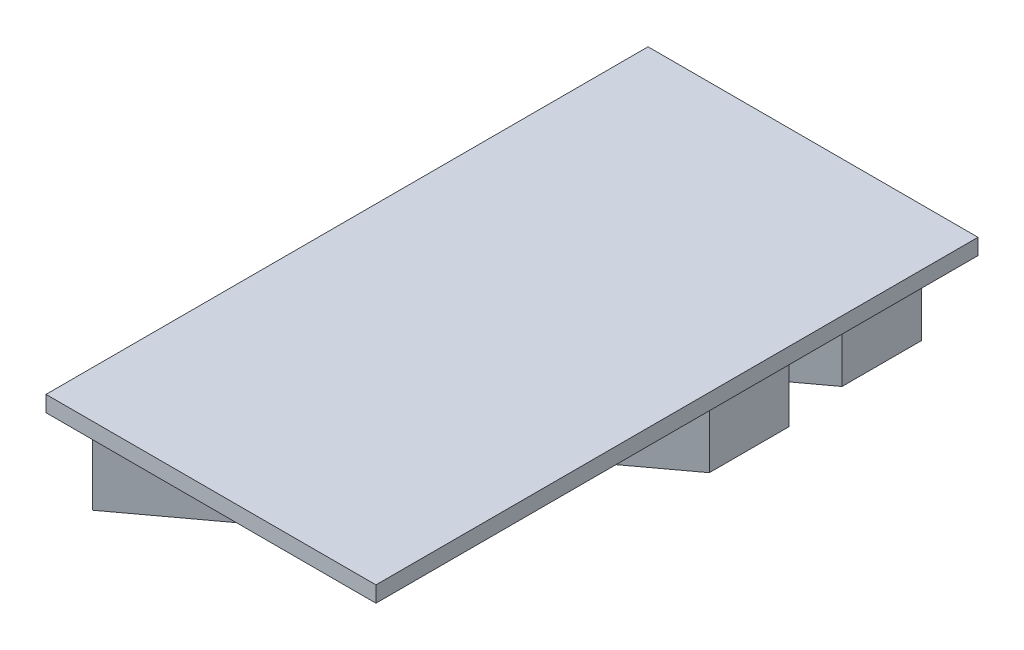
ISO-10303-21;
HEADER;
FILE_DESCRIPTION(('STEP AP214'),'2;1');
FILE_NAME('part.step','',(''),(''),'','','');
FILE_SCHEMA(('AUTOMOTIVE_DESIGN { 1 0 10303 214 1 1 1 1 }'));
ENDSEC;
DATA;
#1=APPLICATION_CONTEXT('core data for automotive mechanical design processes');
#2=APPLICATION_PROTOCOL_DEFINITION('international standard','automotive_design',2000,#1);
#3=PRODUCT_CONTEXT('',#1,'mechanical');
#4=PRODUCT('Part','Part','',(#3));
#5=PRODUCT_RELATED_PRODUCT_CATEGORY('part','',(#4));
#6=PRODUCT_DEFINITION_FORMATION('','',#4);
#7=PRODUCT_DEFINITION_CONTEXT('part definition',#1,'design');
#8=PRODUCT_DEFINITION('design','',#6,#7);
#9=PRODUCT_DEFINITION_SHAPE('','',#8);
#10=(LENGTH_UNIT() NAMED_UNIT(*) SI_UNIT(.MILLI.,.METRE.));
#11=(NAMED_UNIT(*) PLANE_ANGLE_UNIT() SI_UNIT($,.RADIAN.));
#12=(NAMED_UNIT(*) SI_UNIT($,.STERADIAN.) SOLID_ANGLE_UNIT());
#13=UNCERTAINTY_MEASURE_WITH_UNIT(LENGTH_MEASURE(1.E-05),#10,'distance_accuracy_value','');
#14=(GEOMETRIC_REPRESENTATION_CONTEXT(3) GLOBAL_UNCERTAINTY_ASSIGNED_CONTEXT((#13)) GLOBAL_UNIT_ASSIGNED_CONTEXT((#10,
#11,#12)) REPRESENTATION_CONTEXT('',''));
#15=CARTESIAN_POINT('',(0.,0.,0.));
#16=DIRECTION('',(0.,0.,1.));
#17=DIRECTION('',(1.,0.,0.));
#18=AXIS2_PLACEMENT_3D('',#15,#16,#17);
#19=CARTESIAN_POINT('',(0.,1.5,0.));
#20=DIRECTION('',(0.,1.,0.));
#21=DIRECTION('',(0.,0.,1.));
#22=AXIS2_PLACEMENT_3D('',#19,#20,#21);
#23=PLANE('',#22);
#24=DIRECTION('',(-0.804048076479919,0.,0.59456428643919));
#25=VECTOR('',#24,1.);
#26=CARTESIAN_POINT('',(2.25024903153857,1.5,-2.45548713272482));
#27=LINE('',#26,#25);
#28=CARTESIAN_POINT('',(2.25024903153857,1.5,-2.45548713272482));
#29=VERTEX_POINT('',#28);
#30=CARTESIAN_POINT('',(-3.02390068047156,1.5,1.44455460834024));
#31=VERTEX_POINT('',#30);
#32=EDGE_CURVE('E181',#29,#31,#27,.T.);
#33=ORIENTED_EDGE('',*,*,#32,.T.);
#34=DIRECTION('',(0.,0.,1.));
#35=VECTOR('',#34,1.);
#36=CARTESIAN_POINT('',(-3.02390068047156,1.5,1.44455460834024));
#37=LINE('',#36,#35);
#38=CARTESIAN_POINT('',(-3.02390068047156,1.5,2.94588618290913));
#39=VERTEX_POINT('',#38);
#40=EDGE_CURVE('E183',#31,#39,#37,.T.);
#41=ORIENTED_EDGE('',*,*,#40,.T.);
#42=DIRECTION('',(0.804048076479919,0.,-0.59456428643919));
#43=VECTOR('',#42,1.);
#44=CARTESIAN_POINT('',(2.25024903153857,1.5,-0.954155558155932));
#45=LINE('',#44,#43);
#46=CARTESIAN_POINT('',(2.25024903153857,1.5,-0.954155558155932));
#47=VERTEX_POINT('',#46);
#48=EDGE_CURVE('E186',#39,#47,#45,.T.);
#49=ORIENTED_EDGE('',*,*,#48,.T.);
#50=DIRECTION('',(0.,0.,-1.));
#51=VECTOR('',#50,1.);
#52=CARTESIAN_POINT('',(2.25024903153857,1.5,-2.45548713272482));
#53=LINE('',#52,#51);
#54=EDGE_CURVE('E188',#47,#29,#53,.T.);
#55=ORIENTED_EDGE('',*,*,#54,.T.);
#56=EDGE_LOOP('',(#33,#41,#49,#55));
#57=FACE_BOUND('',#56,.T.);
#58=DIRECTION('',(0.,0.,1.));
#59=VECTOR('',#58,1.);
#60=CARTESIAN_POINT('',(-3.48671320168795,1.5,-5.53531411438628));
#61=LINE('',#60,#59);
#62=CARTESIAN_POINT('',(-3.48671320168795,1.5,-5.53531411438628));
#63=VERTEX_POINT('',#62);
#64=CARTESIAN_POINT('',(-3.48671320168795,1.5,5.82267323575311));
#65=VERTEX_POINT('',#64);
#66=EDGE_CURVE('E209',#63,#65,#61,.T.);
#67=ORIENTED_EDGE('',*,*,#66,.F.);
#68=DIRECTION('',(-1.,0.,0.));
#69=VECTOR('',#68,1.);
#70=CARTESIAN_POINT('',(-3.48671320168795,1.5,-5.53531411438628));
#71=LINE('',#70,#69);
#72=CARTESIAN_POINT('',(2.73786065177273,1.5,-5.53531411438628));
#73=VERTEX_POINT('',#72);
#74=EDGE_CURVE('E214',#73,#63,#71,.T.);
#75=ORIENTED_EDGE('',*,*,#74,.F.);
#76=DIRECTION('',(0.,0.,-1.));
#77=VECTOR('',#76,1.);
#78=CARTESIAN_POINT('',(2.73786065177273,1.5,-5.53531411438628));
#79=LINE('',#78,#77);
#80=CARTESIAN_POINT('',(2.73786065177273,1.5,5.82267323575311));
#81=VERTEX_POINT('',#80);
#82=EDGE_CURVE('E225',#81,#73,#79,.T.);
#83=ORIENTED_EDGE('',*,*,#82,.F.);
#84=DIRECTION('',(1.,0.,0.));
#85=VECTOR('',#84,1.);
#86=CARTESIAN_POINT('',(-3.48671320168795,1.5,5.82267323575311));
#87=LINE('',#86,#85);
#88=EDGE_CURVE('E223',#65,#81,#87,.T.);
#89=ORIENTED_EDGE('',*,*,#88,.F.);
#90=EDGE_LOOP('',(#67,#75,#83,#89));
#91=FACE_BOUND('',#90,.T.);
#92=DIRECTION('',(0.,0.,-1.));
#93=VECTOR('',#92,1.);
#94=CARTESIAN_POINT('',(-0.539241248613064,1.5,2.18897007289775));
#95=LINE('',#94,#93);
#96=CARTESIAN_POINT('',(-0.539241248613064,1.5,3.69030164746641));
#97=VERTEX_POINT('',#96);
#98=CARTESIAN_POINT('',(-0.539241248613064,1.5,2.18897007289775));
#99=VERTEX_POINT('',#98);
#100=EDGE_CURVE('E250',#97,#99,#95,.T.);
#101=ORIENTED_EDGE('',*,*,#100,.T.);
#102=DIRECTION('',(-0.804048076479919,0.,0.59456428643919));
#103=VECTOR('',#102,1.);
#104=CARTESIAN_POINT('',(-0.539241248613064,1.5,2.18897007289775));
#105=LINE('',#104,#103);
#106=CARTESIAN_POINT('',(-2.95667956111279,1.5,3.97657771394166));
#107=VERTEX_POINT('',#106);
#108=EDGE_CURVE('E240',#99,#107,#105,.T.);
#109=ORIENTED_EDGE('',*,*,#108,.T.);
#110=DIRECTION('',(0.,0.,1.));
#111=VECTOR('',#110,1.);
#112=CARTESIAN_POINT('',(-2.95667956111279,1.5,3.97657771394166));
#113=LINE('',#112,#111);
#114=CARTESIAN_POINT('',(-2.95667956111279,1.5,5.47790928851032));
#115=VERTEX_POINT('',#114);
#116=EDGE_CURVE('E243',#107,#115,#113,.T.);
#117=ORIENTED_EDGE('',*,*,#116,.T.);
#118=DIRECTION('',(0.804048076479919,0.,-0.59456428643919));
#119=VECTOR('',#118,1.);
#120=CARTESIAN_POINT('',(-0.539241248613064,1.5,3.69030164746641));
#121=LINE('',#120,#119);
#122=EDGE_CURVE('E247',#115,#97,#121,.T.);
#123=ORIENTED_EDGE('',*,*,#122,.T.);
#124=EDGE_LOOP('',(#101,#109,#117,#123));
#125=FACE_BOUND('',#124,.T.);
#126=DIRECTION('',(-0.804048076479919,0.,0.59456428643919));
#127=VECTOR('',#126,1.);
#128=CARTESIAN_POINT('',(2.09356417522834,1.5,-5.11615287009016));
#129=LINE('',#128,#127);
#130=CARTESIAN_POINT('',(2.09356417522834,1.5,-5.11615287009016));
#131=VERTEX_POINT('',#130);
#132=CARTESIAN_POINT('',(-0.323874137271384,1.5,-3.32854522904625));
#133=VERTEX_POINT('',#132);
#134=EDGE_CURVE('E50',#131,#133,#129,.T.);
#135=ORIENTED_EDGE('',*,*,#134,.T.);
#136=DIRECTION('',(0.,0.,1.));
#137=VECTOR('',#136,1.);
#138=CARTESIAN_POINT('',(-0.323874137271384,1.5,-3.32854522904625));
#139=LINE('',#138,#137);
#140=CARTESIAN_POINT('',(-0.323874137271383,1.5,-1.82721365447736));
#141=VERTEX_POINT('',#140);
#142=EDGE_CURVE('E54',#133,#141,#139,.T.);
#143=ORIENTED_EDGE('',*,*,#142,.T.);
#144=DIRECTION('',(0.804048076479919,0.,-0.59456428643919));
#145=VECTOR('',#144,1.);
#146=CARTESIAN_POINT('',(2.09356417522834,1.5,-3.61482129552127));
#147=LINE('',#146,#145);
#148=CARTESIAN_POINT('',(2.09356417522834,1.5,-3.61482129552127));
#149=VERTEX_POINT('',#148);
#150=EDGE_CURVE('E144',#141,#149,#147,.T.);
#151=ORIENTED_EDGE('',*,*,#150,.T.);
#152=DIRECTION('',(0.,0.,-1.));
#153=VECTOR('',#152,1.);
#154=CARTESIAN_POINT('',(2.09356417522834,1.5,-5.11615287009016));
#155=LINE('',#154,#153);
#156=EDGE_CURVE('E147',#149,#131,#155,.T.);
#157=ORIENTED_EDGE('',*,*,#156,.T.);
#158=EDGE_LOOP('',(#135,#143,#151,#157));
#159=FACE_BOUND('',#158,.T.);
#160=ADVANCED_FACE('F35',(#57,#91,#125,#159),#23,.F.);
#161=CARTESIAN_POINT('',(-0.539241248613064,1.5,2.18897007289775));
#162=DIRECTION('',(0.59456428643919,0.,0.804048076479919));
#163=DIRECTION('',(0.804048076479919,0.,-0.59456428643919));
#164=AXIS2_PLACEMENT_3D('',#161,#162,#163);
#165=PLANE('',#164);
#166=DIRECTION('',(-0.804048076479919,0.,0.59456428643919));
#167=VECTOR('',#166,1.);
#168=CARTESIAN_POINT('',(-0.539241248613064,0.,2.18897007289775));
#169=LINE('',#168,#167);
#170=CARTESIAN_POINT('',(-0.539241248613064,0.,2.18897007289775));
#171=VERTEX_POINT('',#170);
#172=CARTESIAN_POINT('',(-2.95667956111279,0.,3.97657771394166));
#173=VERTEX_POINT('',#172);
#174=EDGE_CURVE('E239',#171,#173,#169,.T.);
#175=ORIENTED_EDGE('',*,*,#174,.T.);
#176=DIRECTION('',(0.,-1.,0.));
#177=VECTOR('',#176,1.);
#178=CARTESIAN_POINT('',(-2.95667956111279,1.5,3.97657771394166));
#179=LINE('',#178,#177);
#180=EDGE_CURVE('E11',#107,#173,#179,.T.);
#181=ORIENTED_EDGE('',*,*,#180,.F.);
#182=ORIENTED_EDGE('',*,*,#108,.F.);
#183=DIRECTION('',(0.,-1.,0.));
#184=VECTOR('',#183,1.);
#185=CARTESIAN_POINT('',(-0.539241248613064,1.5,2.18897007289775));
#186=LINE('',#185,#184);
#187=EDGE_CURVE('E253',#99,#171,#186,.T.);
#188=ORIENTED_EDGE('',*,*,#187,.T.);
#189=EDGE_LOOP('',(#175,#181,#182,#188));
#190=FACE_BOUND('',#189,.T.);
#191=ADVANCED_FACE('F37',(#190),#165,.F.);
#192=CARTESIAN_POINT('',(-2.95667956111279,1.5,3.97657771394166));
#193=DIRECTION('',(1.,0.,0.));
#194=DIRECTION('',(0.,0.,-1.));
#195=AXIS2_PLACEMENT_3D('',#192,#193,#194);
#196=PLANE('',#195);
#197=DIRECTION('',(0.,0.,1.));
#198=VECTOR('',#197,1.);
#199=CARTESIAN_POINT('',(-2.95667956111279,0.,3.97657771394166));
#200=LINE('',#199,#198);
#201=CARTESIAN_POINT('',(-2.95667956111279,0.,5.47790928851032));
#202=VERTEX_POINT('',#201);
#203=EDGE_CURVE('E256',#173,#202,#200,.T.);
#204=ORIENTED_EDGE('',*,*,#203,.T.);
#205=DIRECTION('',(0.,-1.,0.));
#206=VECTOR('',#205,1.);
#207=CARTESIAN_POINT('',(-2.95667956111279,1.5,5.47790928851032));
#208=LINE('',#207,#206);
#209=EDGE_CURVE('E43',#115,#202,#208,.T.);
#210=ORIENTED_EDGE('',*,*,#209,.F.);
#211=ORIENTED_EDGE('',*,*,#116,.F.);
#212=ORIENTED_EDGE('',*,*,#180,.T.);
#213=EDGE_LOOP('',(#204,#210,#211,#212));
#214=FACE_BOUND('',#213,.T.);
#215=ADVANCED_FACE('F282',(#214),#196,.F.);
#216=CARTESIAN_POINT('',(-0.539241248613064,1.5,3.69030164746641));
#217=DIRECTION('',(-0.59456428643919,0.,-0.804048076479919));
#218=DIRECTION('',(-0.804048076479919,0.,0.59456428643919));
#219=AXIS2_PLACEMENT_3D('',#216,#217,#218);
#220=PLANE('',#219);
#221=DIRECTION('',(0.804048076479919,0.,-0.59456428643919));
#222=VECTOR('',#221,1.);
#223=CARTESIAN_POINT('',(-0.539241248613064,0.,3.69030164746641));
#224=LINE('',#223,#222);
#225=CARTESIAN_POINT('',(-0.539241248613064,0.,3.69030164746641));
#226=VERTEX_POINT('',#225);
#227=EDGE_CURVE('E258',#202,#226,#224,.T.);
#228=ORIENTED_EDGE('',*,*,#227,.T.);
#229=DIRECTION('',(0.,-1.,0.));
#230=VECTOR('',#229,1.);
#231=CARTESIAN_POINT('',(-0.539241248613064,1.5,3.69030164746641));
#232=LINE('',#231,#230);
#233=EDGE_CURVE('E263',#97,#226,#232,.T.);
#234=ORIENTED_EDGE('',*,*,#233,.F.);
#235=ORIENTED_EDGE('',*,*,#122,.F.);
#236=ORIENTED_EDGE('',*,*,#209,.T.);
#237=EDGE_LOOP('',(#228,#234,#235,#236));
#238=FACE_BOUND('',#237,.T.);
#239=ADVANCED_FACE('F269',(#238),#220,.F.);
#240=CARTESIAN_POINT('',(-0.539241248613064,1.5,2.18897007289775));
#241=DIRECTION('',(-1.,0.,0.));
#242=DIRECTION('',(0.,0.,1.));
#243=AXIS2_PLACEMENT_3D('',#240,#241,#242);
#244=PLANE('',#243);
#245=DIRECTION('',(0.,0.,-1.));
#246=VECTOR('',#245,1.);
#247=CARTESIAN_POINT('',(-0.539241248613064,0.,2.18897007289775));
#248=LINE('',#247,#246);
#249=EDGE_CURVE('E244',#226,#171,#248,.T.);
#250=ORIENTED_EDGE('',*,*,#249,.T.);
#251=ORIENTED_EDGE('',*,*,#187,.F.);
#252=ORIENTED_EDGE('',*,*,#100,.F.);
#253=ORIENTED_EDGE('',*,*,#233,.T.);
#254=EDGE_LOOP('',(#250,#251,#252,#253));
#255=FACE_BOUND('',#254,.T.);
#256=ADVANCED_FACE('F277',(#255),#244,.F.);
#257=CARTESIAN_POINT('',(0.,0.,0.));
#258=DIRECTION('',(0.,1.,0.));
#259=DIRECTION('',(0.,0.,1.));
#260=AXIS2_PLACEMENT_3D('',#257,#258,#259);
#261=PLANE('',#260);
#262=ORIENTED_EDGE('',*,*,#174,.F.);
#263=ORIENTED_EDGE('',*,*,#249,.F.);
#264=ORIENTED_EDGE('',*,*,#227,.F.);
#265=ORIENTED_EDGE('',*,*,#203,.F.);
#266=EDGE_LOOP('',(#262,#263,#264,#265));
#267=FACE_BOUND('',#266,.T.);
#268=ADVANCED_FACE('F274',(#267),#261,.F.);
#269=CARTESIAN_POINT('',(-3.48671320168795,1.8,-5.53531411438628));
#270=DIRECTION('',(1.,0.,0.));
#271=DIRECTION('',(0.,0.,-1.));
#272=AXIS2_PLACEMENT_3D('',#269,#270,#271);
#273=PLANE('',#272);
#274=ORIENTED_EDGE('',*,*,#66,.T.);
#275=DIRECTION('',(0.,-1.,0.));
#276=VECTOR('',#275,1.);
#277=CARTESIAN_POINT('',(-3.48671320168795,1.8,5.82267323575311));
#278=LINE('',#277,#276);
#279=CARTESIAN_POINT('',(-3.48671320168795,1.8,5.82267323575311));
#280=VERTEX_POINT('',#279);
#281=EDGE_CURVE('E236',#280,#65,#278,.T.);
#282=ORIENTED_EDGE('',*,*,#281,.F.);
#283=DIRECTION('',(0.,0.,1.));
#284=VECTOR('',#283,1.);
#285=CARTESIAN_POINT('',(-3.48671320168795,1.8,-5.53531411438628));
#286=LINE('',#285,#284);
#287=CARTESIAN_POINT('',(-3.48671320168795,1.8,-5.53531411438628));
#288=VERTEX_POINT('',#287);
#289=EDGE_CURVE('E210',#288,#280,#286,.T.);
#290=ORIENTED_EDGE('',*,*,#289,.F.);
#291=DIRECTION('',(0.,-1.,0.));
#292=VECTOR('',#291,1.);
#293=CARTESIAN_POINT('',(-3.48671320168795,1.8,-5.53531411438628));
#294=LINE('',#293,#292);
#295=EDGE_CURVE('E220',#288,#63,#294,.T.);
#296=ORIENTED_EDGE('',*,*,#295,.T.);
#297=EDGE_LOOP('',(#274,#282,#290,#296));
#298=FACE_BOUND('',#297,.T.);
#299=ADVANCED_FACE('F310',(#298),#273,.F.);
#300=CARTESIAN_POINT('',(-3.48671320168795,1.8,5.82267323575311));
#301=DIRECTION('',(0.,0.,-1.));
#302=DIRECTION('',(-1.,0.,0.));
#303=AXIS2_PLACEMENT_3D('',#300,#301,#302);
#304=PLANE('',#303);
#305=ORIENTED_EDGE('',*,*,#88,.T.);
#306=DIRECTION('',(0.,-1.,0.));
#307=VECTOR('',#306,1.);
#308=CARTESIAN_POINT('',(2.73786065177273,1.8,5.82267323575311));
#309=LINE('',#308,#307);
#310=CARTESIAN_POINT('',(2.73786065177273,1.8,5.82267323575311));
#311=VERTEX_POINT('',#310);
#312=EDGE_CURVE('E233',#311,#81,#309,.T.);
#313=ORIENTED_EDGE('',*,*,#312,.F.);
#314=DIRECTION('',(1.,0.,0.));
#315=VECTOR('',#314,1.);
#316=CARTESIAN_POINT('',(-3.48671320168795,1.8,5.82267323575311));
#317=LINE('',#316,#315);
#318=EDGE_CURVE('E213',#280,#311,#317,.T.);
#319=ORIENTED_EDGE('',*,*,#318,.F.);
#320=ORIENTED_EDGE('',*,*,#281,.T.);
#321=EDGE_LOOP('',(#305,#313,#319,#320));
#322=FACE_BOUND('',#321,.T.);
#323=ADVANCED_FACE('F306',(#322),#304,.F.);
#324=CARTESIAN_POINT('',(2.73786065177273,1.8,-5.53531411438628));
#325=DIRECTION('',(-1.,0.,0.));
#326=DIRECTION('',(0.,0.,1.));
#327=AXIS2_PLACEMENT_3D('',#324,#325,#326);
#328=PLANE('',#327);
#329=ORIENTED_EDGE('',*,*,#82,.T.);
#330=DIRECTION('',(0.,-1.,0.));
#331=VECTOR('',#330,1.);
#332=CARTESIAN_POINT('',(2.73786065177273,1.8,-5.53531411438628));
#333=LINE('',#332,#331);
#334=CARTESIAN_POINT('',(2.73786065177273,1.8,-5.53531411438628));
#335=VERTEX_POINT('',#334);
#336=EDGE_CURVE('E230',#335,#73,#333,.T.);
#337=ORIENTED_EDGE('',*,*,#336,.F.);
#338=DIRECTION('',(0.,0.,-1.));
#339=VECTOR('',#338,1.);
#340=CARTESIAN_POINT('',(2.73786065177273,1.8,-5.53531411438628));
#341=LINE('',#340,#339);
#342=EDGE_CURVE('E216',#311,#335,#341,.T.);
#343=ORIENTED_EDGE('',*,*,#342,.F.);
#344=ORIENTED_EDGE('',*,*,#312,.T.);
#345=EDGE_LOOP('',(#329,#337,#343,#344));
#346=FACE_BOUND('',#345,.T.);
#347=ADVANCED_FACE('F302',(#346),#328,.F.);
#348=CARTESIAN_POINT('',(-3.48671320168795,1.8,-5.53531411438628));
#349=DIRECTION('',(0.,0.,1.));
#350=DIRECTION('',(1.,0.,0.));
#351=AXIS2_PLACEMENT_3D('',#348,#349,#350);
#352=PLANE('',#351);
#353=ORIENTED_EDGE('',*,*,#74,.T.);
#354=ORIENTED_EDGE('',*,*,#295,.F.);
#355=DIRECTION('',(-1.,0.,0.));
#356=VECTOR('',#355,1.);
#357=CARTESIAN_POINT('',(-3.48671320168795,1.8,-5.53531411438628));
#358=LINE('',#357,#356);
#359=EDGE_CURVE('E218',#335,#288,#358,.T.);
#360=ORIENTED_EDGE('',*,*,#359,.F.);
#361=ORIENTED_EDGE('',*,*,#336,.T.);
#362=EDGE_LOOP('',(#353,#354,#360,#361));
#363=FACE_BOUND('',#362,.T.);
#364=ADVANCED_FACE('F299',(#363),#352,.F.);
#365=CARTESIAN_POINT('',(0.,1.8,0.));
#366=DIRECTION('',(0.,1.,0.));
#367=DIRECTION('',(0.,0.,1.));
#368=AXIS2_PLACEMENT_3D('',#365,#366,#367);
#369=PLANE('',#368);
#370=ORIENTED_EDGE('',*,*,#289,.T.);
#371=ORIENTED_EDGE('',*,*,#318,.T.);
#372=ORIENTED_EDGE('',*,*,#342,.T.);
#373=ORIENTED_EDGE('',*,*,#359,.T.);
#374=EDGE_LOOP('',(#370,#371,#372,#373));
#375=FACE_BOUND('',#374,.T.);
#376=ADVANCED_FACE('F297',(#375),#369,.T.);
#377=CARTESIAN_POINT('',(2.25024903153857,1.5,-2.45548713272482));
#378=DIRECTION('',(0.59456428643919,0.,0.804048076479919));
#379=DIRECTION('',(0.804048076479919,0.,-0.59456428643919));
#380=AXIS2_PLACEMENT_3D('',#377,#378,#379);
#381=PLANE('',#380);
#382=DIRECTION('',(-0.804048076479919,0.,0.59456428643919));
#383=VECTOR('',#382,1.);
#384=CARTESIAN_POINT('',(2.25024903153857,0.,-2.45548713272482));
#385=LINE('',#384,#383);
#386=CARTESIAN_POINT('',(2.25024903153857,0.,-2.45548713272482));
#387=VERTEX_POINT('',#386);
#388=CARTESIAN_POINT('',(-3.02390068047156,0.,1.44455460834024));
#389=VERTEX_POINT('',#388);
#390=EDGE_CURVE('E180',#387,#389,#385,.T.);
#391=ORIENTED_EDGE('',*,*,#390,.T.);
#392=DIRECTION('',(0.,-1.,0.));
#393=VECTOR('',#392,1.);
#394=CARTESIAN_POINT('',(-3.02390068047156,1.5,1.44455460834024));
#395=LINE('',#394,#393);
#396=EDGE_CURVE('E206',#31,#389,#395,.T.);
#397=ORIENTED_EDGE('',*,*,#396,.F.);
#398=ORIENTED_EDGE('',*,*,#32,.F.);
#399=DIRECTION('',(0.,-1.,0.));
#400=VECTOR('',#399,1.);
#401=CARTESIAN_POINT('',(2.25024903153857,1.5,-2.45548713272482));
#402=LINE('',#401,#400);
#403=EDGE_CURVE('E190',#29,#387,#402,.T.);
#404=ORIENTED_EDGE('',*,*,#403,.T.);
#405=EDGE_LOOP('',(#391,#397,#398,#404));
#406=FACE_BOUND('',#405,.T.);
#407=ADVANCED_FACE('F348',(#406),#381,.F.);
#408=CARTESIAN_POINT('',(-3.02390068047156,1.5,1.44455460834024));
#409=DIRECTION('',(1.,0.,0.));
#410=DIRECTION('',(0.,0.,-1.));
#411=AXIS2_PLACEMENT_3D('',#408,#409,#410);
#412=PLANE('',#411);
#413=DIRECTION('',(0.,0.,1.));
#414=VECTOR('',#413,1.);
#415=CARTESIAN_POINT('',(-3.02390068047156,0.,1.44455460834024));
#416=LINE('',#415,#414);
#417=CARTESIAN_POINT('',(-3.02390068047156,0.,2.94588618290913));
#418=VERTEX_POINT('',#417);
#419=EDGE_CURVE('E193',#389,#418,#416,.T.);
#420=ORIENTED_EDGE('',*,*,#419,.T.);
#421=DIRECTION('',(0.,-1.,0.));
#422=VECTOR('',#421,1.);
#423=CARTESIAN_POINT('',(-3.02390068047156,1.5,2.94588618290913));
#424=LINE('',#423,#422);
#425=EDGE_CURVE('E203',#39,#418,#424,.T.);
#426=ORIENTED_EDGE('',*,*,#425,.F.);
#427=ORIENTED_EDGE('',*,*,#40,.F.);
#428=ORIENTED_EDGE('',*,*,#396,.T.);
#429=EDGE_LOOP('',(#420,#426,#427,#428));
#430=FACE_BOUND('',#429,.T.);
#431=ADVANCED_FACE('F355',(#430),#412,.F.);
#432=CARTESIAN_POINT('',(2.25024903153857,1.5,-0.954155558155932));
#433=DIRECTION('',(-0.59456428643919,0.,-0.804048076479919));
#434=DIRECTION('',(-0.804048076479919,0.,0.59456428643919));
#435=AXIS2_PLACEMENT_3D('',#432,#433,#434);
#436=PLANE('',#435);
#437=DIRECTION('',(0.804048076479919,0.,-0.59456428643919));
#438=VECTOR('',#437,1.);
#439=CARTESIAN_POINT('',(2.25024903153857,0.,-0.954155558155932));
#440=LINE('',#439,#438);
#441=CARTESIAN_POINT('',(2.25024903153857,0.,-0.954155558155932));
#442=VERTEX_POINT('',#441);
#443=EDGE_CURVE('E195',#418,#442,#440,.T.);
#444=ORIENTED_EDGE('',*,*,#443,.T.);
#445=DIRECTION('',(0.,-1.,0.));
#446=VECTOR('',#445,1.);
#447=CARTESIAN_POINT('',(2.25024903153857,1.5,-0.954155558155932));
#448=LINE('',#447,#446);
#449=EDGE_CURVE('E200',#47,#442,#448,.T.);
#450=ORIENTED_EDGE('',*,*,#449,.F.);
#451=ORIENTED_EDGE('',*,*,#48,.F.);
#452=ORIENTED_EDGE('',*,*,#425,.T.);
#453=EDGE_LOOP('',(#444,#450,#451,#452));
#454=FACE_BOUND('',#453,.T.);
#455=ADVANCED_FACE('F362',(#454),#436,.F.);
#456=CARTESIAN_POINT('',(2.25024903153857,1.5,-2.45548713272482));
#457=DIRECTION('',(-1.,0.,0.));
#458=DIRECTION('',(0.,0.,1.));
#459=AXIS2_PLACEMENT_3D('',#456,#457,#458);
#460=PLANE('',#459);
#461=DIRECTION('',(0.,0.,-1.));
#462=VECTOR('',#461,1.);
#463=CARTESIAN_POINT('',(2.25024903153857,0.,-2.45548713272482));
#464=LINE('',#463,#462);
#465=EDGE_CURVE('E184',#442,#387,#464,.T.);
#466=ORIENTED_EDGE('',*,*,#465,.T.);
#467=ORIENTED_EDGE('',*,*,#403,.F.);
#468=ORIENTED_EDGE('',*,*,#54,.F.);
#469=ORIENTED_EDGE('',*,*,#449,.T.);
#470=EDGE_LOOP('',(#466,#467,#468,#469));
#471=FACE_BOUND('',#470,.T.);
#472=ADVANCED_FACE('F370',(#471),#460,.F.);
#473=CARTESIAN_POINT('',(0.,0.,0.));
#474=DIRECTION('',(0.,1.,0.));
#475=DIRECTION('',(0.,0.,1.));
#476=AXIS2_PLACEMENT_3D('',#473,#474,#475);
#477=PLANE('',#476);
#478=ORIENTED_EDGE('',*,*,#390,.F.);
#479=ORIENTED_EDGE('',*,*,#465,.F.);
#480=ORIENTED_EDGE('',*,*,#443,.F.);
#481=ORIENTED_EDGE('',*,*,#419,.F.);
#482=EDGE_LOOP('',(#478,#479,#480,#481));
#483=FACE_BOUND('',#482,.T.);
#484=ADVANCED_FACE('F378',(#483),#477,.F.);
#485=CARTESIAN_POINT('',(2.09356417522834,1.5,-5.11615287009016));
#486=DIRECTION('',(0.59456428643919,0.,0.804048076479919));
#487=DIRECTION('',(0.804048076479919,0.,-0.59456428643919));
#488=AXIS2_PLACEMENT_3D('',#485,#486,#487);
#489=PLANE('',#488);
#490=DIRECTION('',(-0.804048076479919,0.,0.59456428643919));
#491=VECTOR('',#490,1.);
#492=CARTESIAN_POINT('',(2.09356417522834,0.,-5.11615287009016));
#493=LINE('',#492,#491);
#494=CARTESIAN_POINT('',(2.09356417522834,0.,-5.11615287009016));
#495=VERTEX_POINT('',#494);
#496=CARTESIAN_POINT('',(-0.323874137271384,0.,-3.32854522904625));
#497=VERTEX_POINT('',#496);
#498=EDGE_CURVE('E168',#495,#497,#493,.T.);
#499=ORIENTED_EDGE('',*,*,#498,.T.);
#500=DIRECTION('',(0.,-1.,0.));
#501=VECTOR('',#500,1.);
#502=CARTESIAN_POINT('',(-0.323874137271384,1.5,-3.32854522904625));
#503=LINE('',#502,#501);
#504=EDGE_CURVE('E177',#133,#497,#503,.T.);
#505=ORIENTED_EDGE('',*,*,#504,.F.);
#506=ORIENTED_EDGE('',*,*,#134,.F.);
#507=DIRECTION('',(0.,-1.,0.));
#508=VECTOR('',#507,1.);
#509=CARTESIAN_POINT('',(2.09356417522834,1.5,-5.11615287009016));
#510=LINE('',#509,#508);
#511=EDGE_CURVE('E160',#131,#495,#510,.T.);
#512=ORIENTED_EDGE('',*,*,#511,.T.);
#513=EDGE_LOOP('',(#499,#505,#506,#512));
#514=FACE_BOUND('',#513,.T.);
#515=ADVANCED_FACE('F386',(#514),#489,.F.);
#516=CARTESIAN_POINT('',(-0.323874137271384,1.5,-3.32854522904625));
#517=DIRECTION('',(1.,0.,0.));
#518=DIRECTION('',(0.,0.,-1.));
#519=AXIS2_PLACEMENT_3D('',#516,#517,#518);
#520=PLANE('',#519);
#521=DIRECTION('',(0.,0.,1.));
#522=VECTOR('',#521,1.);
#523=CARTESIAN_POINT('',(-0.323874137271384,0.,-3.32854522904625));
#524=LINE('',#523,#522);
#525=CARTESIAN_POINT('',(-0.323874137271384,0.,-1.82721365447737));
#526=VERTEX_POINT('',#525);
#527=EDGE_CURVE('E171',#497,#526,#524,.T.);
#528=ORIENTED_EDGE('',*,*,#527,.T.);
#529=DIRECTION('',(0.,-1.,0.));
#530=VECTOR('',#529,1.);
#531=CARTESIAN_POINT('',(-0.323874137271384,1.5,-1.82721365447737));
#532=LINE('',#531,#530);
#533=EDGE_CURVE('E159',#141,#526,#532,.T.);
#534=ORIENTED_EDGE('',*,*,#533,.F.);
#535=ORIENTED_EDGE('',*,*,#142,.F.);
#536=ORIENTED_EDGE('',*,*,#504,.T.);
#537=EDGE_LOOP('',(#528,#534,#535,#536));
#538=FACE_BOUND('',#537,.T.);
#539=ADVANCED_FACE('F394',(#538),#520,.F.);
#540=CARTESIAN_POINT('',(2.09356417522834,1.5,-3.61482129552127));
#541=DIRECTION('',(-0.59456428643919,0.,-0.804048076479919));
#542=DIRECTION('',(-0.804048076479919,0.,0.59456428643919));
#543=AXIS2_PLACEMENT_3D('',#540,#541,#542);
#544=PLANE('',#543);
#545=DIRECTION('',(0.804048076479919,0.,-0.59456428643919));
#546=VECTOR('',#545,1.);
#547=CARTESIAN_POINT('',(2.09356417522834,0.,-3.61482129552127));
#548=LINE('',#547,#546);
#549=CARTESIAN_POINT('',(2.09356417522834,0.,-3.61482129552127));
#550=VERTEX_POINT('',#549);
#551=EDGE_CURVE('E156',#526,#550,#548,.T.);
#552=ORIENTED_EDGE('',*,*,#551,.T.);
#553=DIRECTION('',(0.,-1.,0.));
#554=VECTOR('',#553,1.);
#555=CARTESIAN_POINT('',(2.09356417522834,1.5,-3.61482129552127));
#556=LINE('',#555,#554);
#557=EDGE_CURVE('E153',#149,#550,#556,.T.);
#558=ORIENTED_EDGE('',*,*,#557,.F.);
#559=ORIENTED_EDGE('',*,*,#150,.F.);
#560=ORIENTED_EDGE('',*,*,#533,.T.);
#561=EDGE_LOOP('',(#552,#558,#559,#560));
#562=FACE_BOUND('',#561,.T.);
#563=ADVANCED_FACE('F154',(#562),#544,.F.);
#564=CARTESIAN_POINT('',(2.09356417522834,1.5,-5.11615287009016));
#565=DIRECTION('',(-1.,0.,0.));
#566=DIRECTION('',(0.,0.,1.));
#567=AXIS2_PLACEMENT_3D('',#564,#565,#566);
#568=PLANE('',#567);
#569=DIRECTION('',(0.,0.,-1.));
#570=VECTOR('',#569,1.);
#571=CARTESIAN_POINT('',(2.09356417522834,0.,-5.11615287009016));
#572=LINE('',#571,#570);
#573=EDGE_CURVE('E174',#550,#495,#572,.T.);
#574=ORIENTED_EDGE('',*,*,#573,.T.);
#575=ORIENTED_EDGE('',*,*,#511,.F.);
#576=ORIENTED_EDGE('',*,*,#156,.F.);
#577=ORIENTED_EDGE('',*,*,#557,.T.);
#578=EDGE_LOOP('',(#574,#575,#576,#577));
#579=FACE_BOUND('',#578,.T.);
#580=ADVANCED_FACE('F162',(#579),#568,.F.);
#581=CARTESIAN_POINT('',(0.,0.,0.));
#582=DIRECTION('',(0.,1.,0.));
#583=DIRECTION('',(0.,0.,1.));
#584=AXIS2_PLACEMENT_3D('',#581,#582,#583);
#585=PLANE('',#584);
#586=ORIENTED_EDGE('',*,*,#498,.F.);
#587=ORIENTED_EDGE('',*,*,#573,.F.);
#588=ORIENTED_EDGE('',*,*,#551,.F.);
#589=ORIENTED_EDGE('',*,*,#527,.F.);
#590=EDGE_LOOP('',(#586,#587,#588,#589));
#591=FACE_BOUND('',#590,.T.);
#592=ADVANCED_FACE('F415',(#591),#585,.F.);
#593=CLOSED_SHELL('',(#160,#191,#215,#239,#256,#268,#299,#323,#347,#364,#376,#407,#431,#455,
#472,#484,#515,#539,#563,#580,#592));
#594=MANIFOLD_SOLID_BREP('B2',#593);
#595=ADVANCED_BREP_SHAPE_REPRESENTATION('',(#18,#594),#14);
#596=SHAPE_DEFINITION_REPRESENTATION(#9,#595);
ENDSEC;
END-ISO-10303-21;
